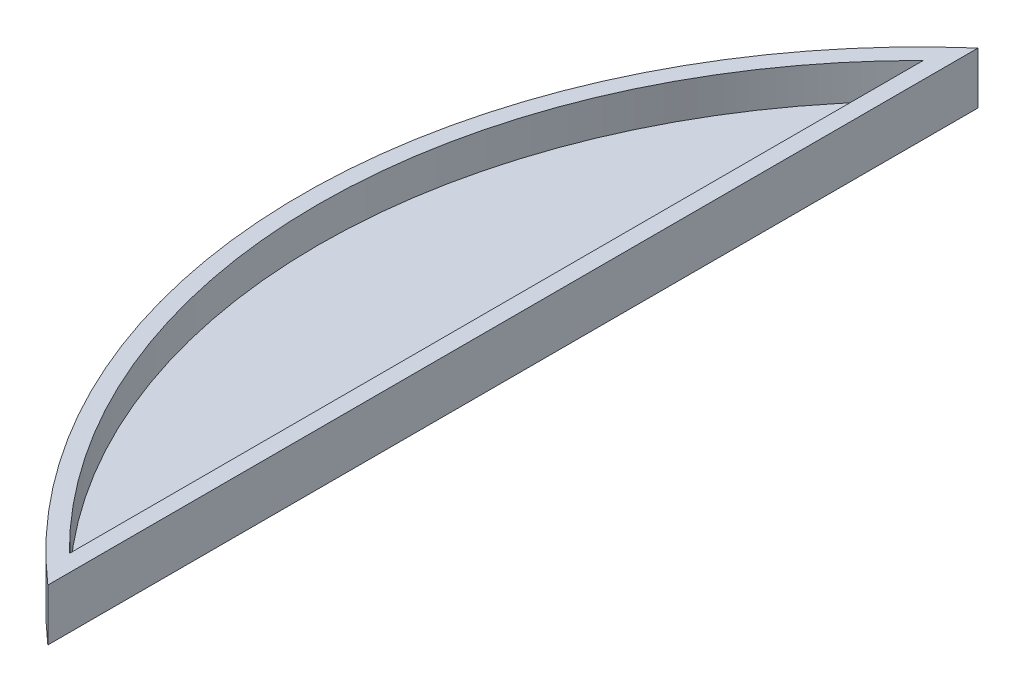
ISO-10303-21;
HEADER;
FILE_DESCRIPTION(('STEP AP214'),'2;1');
FILE_NAME('part.step','',(''),(''),'','','');
FILE_SCHEMA(('AUTOMOTIVE_DESIGN { 1 0 10303 214 1 1 1 1 }'));
ENDSEC;
DATA;
#1=APPLICATION_CONTEXT('core data for automotive mechanical design processes');
#2=APPLICATION_PROTOCOL_DEFINITION('international standard','automotive_design',2000,#1);
#3=PRODUCT_CONTEXT('',#1,'mechanical');
#4=PRODUCT('Part','Part','',(#3));
#5=PRODUCT_RELATED_PRODUCT_CATEGORY('part','',(#4));
#6=PRODUCT_DEFINITION_FORMATION('','',#4);
#7=PRODUCT_DEFINITION_CONTEXT('part definition',#1,'design');
#8=PRODUCT_DEFINITION('design','',#6,#7);
#9=PRODUCT_DEFINITION_SHAPE('','',#8);
#10=(LENGTH_UNIT() NAMED_UNIT(*) SI_UNIT(.MILLI.,.METRE.));
#11=(NAMED_UNIT(*) PLANE_ANGLE_UNIT() SI_UNIT($,.RADIAN.));
#12=(NAMED_UNIT(*) SI_UNIT($,.STERADIAN.) SOLID_ANGLE_UNIT());
#13=UNCERTAINTY_MEASURE_WITH_UNIT(LENGTH_MEASURE(1.E-05),#10,'distance_accuracy_value','');
#14=(GEOMETRIC_REPRESENTATION_CONTEXT(3) GLOBAL_UNCERTAINTY_ASSIGNED_CONTEXT((#13)) GLOBAL_UNIT_ASSIGNED_CONTEXT((#10,
#11,#12)) REPRESENTATION_CONTEXT('',''));
#15=CARTESIAN_POINT('',(0.,0.,0.));
#16=DIRECTION('',(0.,0.,1.));
#17=DIRECTION('',(1.,0.,0.));
#18=AXIS2_PLACEMENT_3D('',#15,#16,#17);
#19=CARTESIAN_POINT('',(0.,6.35,0.));
#20=DIRECTION('',(0.,1.,0.));
#21=DIRECTION('',(0.,0.,1.));
#22=AXIS2_PLACEMENT_3D('',#19,#20,#21);
#23=PLANE('',#22);
#24=DIRECTION('',(0.,0.,1.));
#25=VECTOR('',#24,1.);
#26=CARTESIAN_POINT('',(0.,6.35,0.));
#27=LINE('',#26,#25);
#28=CARTESIAN_POINT('',(0.,6.35,0.));
#29=VERTEX_POINT('',#28);
#30=CARTESIAN_POINT('',(0.,6.35,113.792));
#31=VERTEX_POINT('',#30);
#32=EDGE_CURVE('E85',#29,#31,#27,.T.);
#33=ORIENTED_EDGE('',*,*,#32,.F.);
#34=CARTESIAN_POINT('',(49.7284064594875,6.35,56.896));
#35=DIRECTION('',(0.,1.,0.));
#36=DIRECTION('',(0.,0.,1.));
#37=AXIS2_PLACEMENT_3D('',#34,#35,#36);
#38=CIRCLE('',#37,75.565);
#39=EDGE_CURVE('E69',#29,#31,#38,.T.);
#40=ORIENTED_EDGE('',*,*,#39,.T.);
#41=EDGE_LOOP('',(#33,#40));
#42=FACE_BOUND('',#41,.T.);
#43=CARTESIAN_POINT('',(49.7284064594875,6.35,56.896));
#44=DIRECTION('',(0.,1.,0.));
#45=DIRECTION('',(0.,0.,1.));
#46=AXIS2_PLACEMENT_3D('',#43,#44,#45);
#47=CIRCLE('',#46,73.533);
#48=CARTESIAN_POINT('',(-2.032,6.35,4.66610040074132));
#49=VERTEX_POINT('',#48);
#50=CARTESIAN_POINT('',(-2.03199999999999,6.35,109.125899599259));
#51=VERTEX_POINT('',#50);
#52=EDGE_CURVE('E106',#49,#51,#47,.T.);
#53=ORIENTED_EDGE('',*,*,#52,.F.);
#54=DIRECTION('',(0.,0.,1.));
#55=VECTOR('',#54,1.);
#56=CARTESIAN_POINT('',(-2.032,6.35,0.));
#57=LINE('',#56,#55);
#58=EDGE_CURVE('E61',#49,#51,#57,.T.);
#59=ORIENTED_EDGE('',*,*,#58,.T.);
#60=EDGE_LOOP('',(#53,#59));
#61=FACE_BOUND('',#60,.T.);
#62=ADVANCED_FACE('F45',(#42,#61),#23,.T.);
#63=CARTESIAN_POINT('',(0.,6.35,0.));
#64=DIRECTION('',(1.,0.,0.));
#65=DIRECTION('',(0.,0.,-1.));
#66=AXIS2_PLACEMENT_3D('',#63,#64,#65);
#67=PLANE('',#66);
#68=DIRECTION('',(0.,0.,1.));
#69=VECTOR('',#68,1.);
#70=CARTESIAN_POINT('',(0.,0.,0.));
#71=LINE('',#70,#69);
#72=CARTESIAN_POINT('',(0.,0.,0.));
#73=VERTEX_POINT('',#72);
#74=CARTESIAN_POINT('',(0.,0.,113.792));
#75=VERTEX_POINT('',#74);
#76=EDGE_CURVE('E84',#73,#75,#71,.T.);
#77=ORIENTED_EDGE('',*,*,#76,.F.);
#78=DIRECTION('',(0.,-1.,0.));
#79=VECTOR('',#78,1.);
#80=CARTESIAN_POINT('',(0.,6.35,0.));
#81=LINE('',#80,#79);
#82=EDGE_CURVE('E11',#29,#73,#81,.T.);
#83=ORIENTED_EDGE('',*,*,#82,.F.);
#84=ORIENTED_EDGE('',*,*,#32,.T.);
#85=DIRECTION('',(0.,-1.,0.));
#86=VECTOR('',#85,1.);
#87=CARTESIAN_POINT('',(0.,6.35,113.792));
#88=LINE('',#87,#86);
#89=EDGE_CURVE('E54',#31,#75,#88,.T.);
#90=ORIENTED_EDGE('',*,*,#89,.T.);
#91=EDGE_LOOP('',(#77,#83,#84,#90));
#92=FACE_BOUND('',#91,.T.);
#93=ADVANCED_FACE('F47',(#92),#67,.T.);
#94=CARTESIAN_POINT('',(49.7284064594875,6.35,56.896));
#95=DIRECTION('',(0.,-1.,0.));
#96=DIRECTION('',(0.,0.,-1.));
#97=AXIS2_PLACEMENT_3D('',#94,#95,#96);
#98=CYLINDRICAL_SURFACE('',#97,75.565);
#99=CARTESIAN_POINT('',(49.7284064594875,0.,56.896));
#100=DIRECTION('',(0.,1.,0.));
#101=DIRECTION('',(0.,0.,1.));
#102=AXIS2_PLACEMENT_3D('',#99,#100,#101);
#103=CIRCLE('',#102,75.565);
#104=EDGE_CURVE('E89',#73,#75,#103,.T.);
#105=ORIENTED_EDGE('',*,*,#104,.T.);
#106=ORIENTED_EDGE('',*,*,#89,.F.);
#107=ORIENTED_EDGE('',*,*,#39,.F.);
#108=ORIENTED_EDGE('',*,*,#82,.T.);
#109=EDGE_LOOP('',(#105,#106,#107,#108));
#110=FACE_BOUND('',#109,.T.);
#111=ADVANCED_FACE('F90',(#110),#98,.T.);
#112=CARTESIAN_POINT('',(0.,0.,0.));
#113=DIRECTION('',(0.,1.,0.));
#114=DIRECTION('',(0.,0.,1.));
#115=AXIS2_PLACEMENT_3D('',#112,#113,#114);
#116=PLANE('',#115);
#117=ORIENTED_EDGE('',*,*,#76,.T.);
#118=ORIENTED_EDGE('',*,*,#104,.F.);
#119=EDGE_LOOP('',(#117,#118));
#120=FACE_BOUND('',#119,.T.);
#121=ADVANCED_FACE('F94',(#120),#116,.F.);
#122=CARTESIAN_POINT('',(-2.032,6.35,0.));
#123=DIRECTION('',(1.,0.,0.));
#124=DIRECTION('',(0.,0.,-1.));
#125=AXIS2_PLACEMENT_3D('',#122,#123,#124);
#126=PLANE('',#125);
#127=DIRECTION('',(0.,0.,1.));
#128=VECTOR('',#127,1.);
#129=CARTESIAN_POINT('',(-2.032,2.032,0.));
#130=LINE('',#129,#128);
#131=CARTESIAN_POINT('',(-2.032,2.032,4.66610040074132));
#132=VERTEX_POINT('',#131);
#133=CARTESIAN_POINT('',(-2.03199999999999,2.032,109.125899599259));
#134=VERTEX_POINT('',#133);
#135=EDGE_CURVE('E116',#132,#134,#130,.T.);
#136=ORIENTED_EDGE('',*,*,#135,.T.);
#137=DIRECTION('',(0.,-1.,0.));
#138=VECTOR('',#137,1.);
#139=CARTESIAN_POINT('',(-2.03199999999999,6.35,109.125899599259));
#140=LINE('',#139,#138);
#141=EDGE_CURVE('E99',#51,#134,#140,.T.);
#142=ORIENTED_EDGE('',*,*,#141,.F.);
#143=ORIENTED_EDGE('',*,*,#58,.F.);
#144=DIRECTION('',(0.,-1.,0.));
#145=VECTOR('',#144,1.);
#146=CARTESIAN_POINT('',(-2.032,6.35,4.66610040074132));
#147=LINE('',#146,#145);
#148=EDGE_CURVE('E96',#49,#132,#147,.T.);
#149=ORIENTED_EDGE('',*,*,#148,.T.);
#150=EDGE_LOOP('',(#136,#142,#143,#149));
#151=FACE_BOUND('',#150,.T.);
#152=ADVANCED_FACE('F124',(#151),#126,.F.);
#153=CARTESIAN_POINT('',(49.7284064594875,6.35,56.896));
#154=DIRECTION('',(0.,-1.,0.));
#155=DIRECTION('',(0.,0.,-1.));
#156=AXIS2_PLACEMENT_3D('',#153,#154,#155);
#157=CYLINDRICAL_SURFACE('',#156,73.533);
#158=CARTESIAN_POINT('',(49.7284064594875,2.032,56.896));
#159=DIRECTION('',(0.,1.,0.));
#160=DIRECTION('',(0.,0.,1.));
#161=AXIS2_PLACEMENT_3D('',#158,#159,#160);
#162=CIRCLE('',#161,73.533);
#163=EDGE_CURVE('E112',#132,#134,#162,.T.);
#164=ORIENTED_EDGE('',*,*,#163,.F.);
#165=ORIENTED_EDGE('',*,*,#148,.F.);
#166=ORIENTED_EDGE('',*,*,#52,.T.);
#167=ORIENTED_EDGE('',*,*,#141,.T.);
#168=EDGE_LOOP('',(#164,#165,#166,#167));
#169=FACE_BOUND('',#168,.T.);
#170=ADVANCED_FACE('F133',(#169),#157,.F.);
#171=CARTESIAN_POINT('',(0.,2.032,0.));
#172=DIRECTION('',(0.,1.,0.));
#173=DIRECTION('',(0.,0.,1.));
#174=AXIS2_PLACEMENT_3D('',#171,#172,#173);
#175=PLANE('',#174);
#176=ORIENTED_EDGE('',*,*,#135,.F.);
#177=ORIENTED_EDGE('',*,*,#163,.T.);
#178=EDGE_LOOP('',(#176,#177));
#179=FACE_BOUND('',#178,.T.);
#180=ADVANCED_FACE('F129',(#179),#175,.T.);
#181=CLOSED_SHELL('',(#62,#93,#111,#121,#152,#170,#180));
#182=MANIFOLD_SOLID_BREP('B2',#181);
#183=ADVANCED_BREP_SHAPE_REPRESENTATION('',(#18,#182),#14);
#184=SHAPE_DEFINITION_REPRESENTATION(#9,#183);
ENDSEC;
END-ISO-10303-21;
